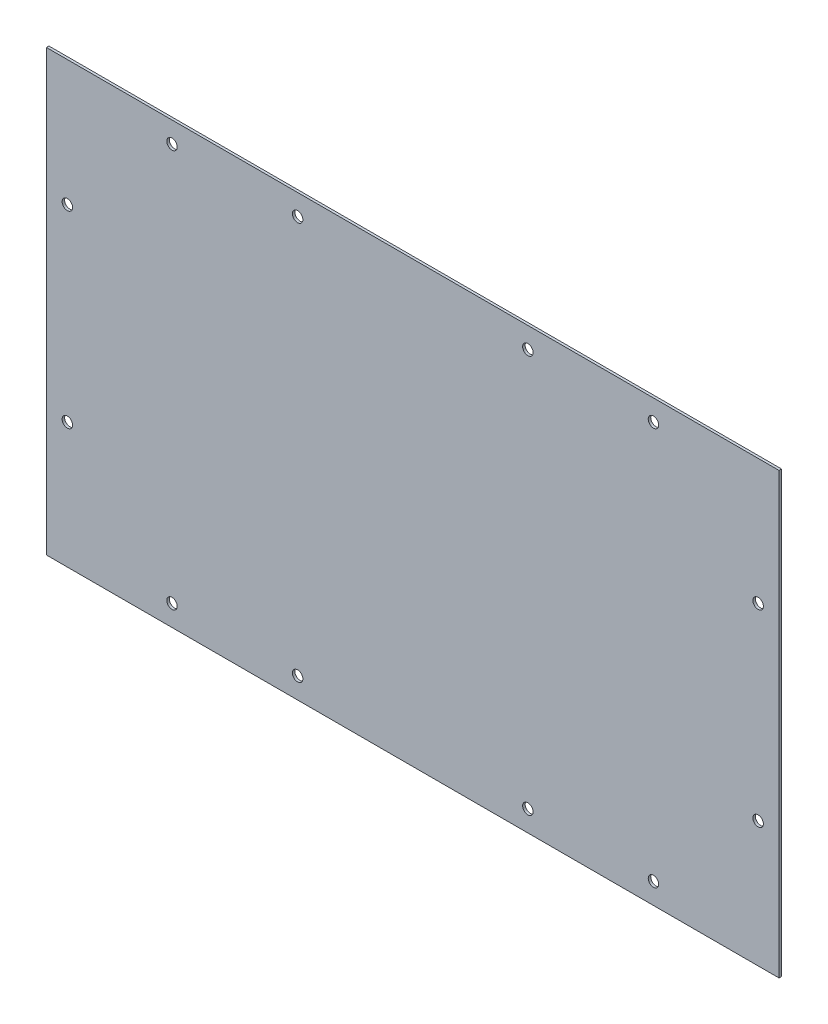
ISO-10303-21;
HEADER;
FILE_DESCRIPTION(('STEP AP214'),'2;1');
FILE_NAME('part.step','',(''),(''),'','','');
FILE_SCHEMA(('AUTOMOTIVE_DESIGN { 1 0 10303 214 1 1 1 1 }'));
ENDSEC;
DATA;
#1=APPLICATION_CONTEXT('core data for automotive mechanical design processes');
#2=APPLICATION_PROTOCOL_DEFINITION('international standard','automotive_design',2000,#1);
#3=PRODUCT_CONTEXT('',#1,'mechanical');
#4=PRODUCT('Part','Part','',(#3));
#5=PRODUCT_RELATED_PRODUCT_CATEGORY('part','',(#4));
#6=PRODUCT_DEFINITION_FORMATION('','',#4);
#7=PRODUCT_DEFINITION_CONTEXT('part definition',#1,'design');
#8=PRODUCT_DEFINITION('design','',#6,#7);
#9=PRODUCT_DEFINITION_SHAPE('','',#8);
#10=(LENGTH_UNIT() NAMED_UNIT(*) SI_UNIT(.MILLI.,.METRE.));
#11=(NAMED_UNIT(*) PLANE_ANGLE_UNIT() SI_UNIT($,.RADIAN.));
#12=(NAMED_UNIT(*) SI_UNIT($,.STERADIAN.) SOLID_ANGLE_UNIT());
#13=UNCERTAINTY_MEASURE_WITH_UNIT(LENGTH_MEASURE(1.E-05),#10,'distance_accuracy_value','');
#14=(GEOMETRIC_REPRESENTATION_CONTEXT(3) GLOBAL_UNCERTAINTY_ASSIGNED_CONTEXT((#13)) GLOBAL_UNIT_ASSIGNED_CONTEXT((#10,
#11,#12)) REPRESENTATION_CONTEXT('',''));
#15=CARTESIAN_POINT('',(0.,0.,0.));
#16=DIRECTION('',(0.,0.,1.));
#17=DIRECTION('',(1.,0.,0.));
#18=AXIS2_PLACEMENT_3D('',#15,#16,#17);
#19=CARTESIAN_POINT('',(0.,0.,0.));
#20=DIRECTION('',(-1.,0.,0.));
#21=DIRECTION('',(0.,1.,0.));
#22=AXIS2_PLACEMENT_3D('',#19,#20,#21);
#23=PLANE('',#22);
#24=DIRECTION('',(0.,0.,-1.));
#25=VECTOR('',#24,1.);
#26=CARTESIAN_POINT('',(0.,0.,0.));
#27=LINE('',#26,#25);
#28=CARTESIAN_POINT('',(0.,0.,1.2));
#29=VERTEX_POINT('',#28);
#30=CARTESIAN_POINT('',(0.,0.,0.));
#31=VERTEX_POINT('',#30);
#32=EDGE_CURVE('E11',#29,#31,#27,.T.);
#33=ORIENTED_EDGE('',*,*,#32,.F.);
#34=DIRECTION('',(0.,1.,0.));
#35=VECTOR('',#34,1.);
#36=CARTESIAN_POINT('',(0.,0.,1.2));
#37=LINE('',#36,#35);
#38=CARTESIAN_POINT('',(0.,210.,1.2));
#39=VERTEX_POINT('',#38);
#40=EDGE_CURVE('E70',#29,#39,#37,.T.);
#41=ORIENTED_EDGE('',*,*,#40,.T.);
#42=DIRECTION('',(0.,0.,-1.));
#43=VECTOR('',#42,1.);
#44=CARTESIAN_POINT('',(0.,210.,0.));
#45=LINE('',#44,#43);
#46=CARTESIAN_POINT('',(0.,210.,0.));
#47=VERTEX_POINT('',#46);
#48=EDGE_CURVE('E45',#39,#47,#45,.T.);
#49=ORIENTED_EDGE('',*,*,#48,.T.);
#50=DIRECTION('',(0.,1.,0.));
#51=VECTOR('',#50,1.);
#52=CARTESIAN_POINT('',(0.,0.,0.));
#53=LINE('',#52,#51);
#54=EDGE_CURVE('E72',#31,#47,#53,.T.);
#55=ORIENTED_EDGE('',*,*,#54,.F.);
#56=EDGE_LOOP('',(#33,#41,#49,#55));
#57=FACE_BOUND('',#56,.T.);
#58=ADVANCED_FACE('F35',(#57),#23,.T.);
#59=CARTESIAN_POINT('',(0.,210.,0.));
#60=DIRECTION('',(0.,1.,0.));
#61=DIRECTION('',(1.,0.,0.));
#62=AXIS2_PLACEMENT_3D('',#59,#60,#61);
#63=PLANE('',#62);
#64=ORIENTED_EDGE('',*,*,#48,.F.);
#65=DIRECTION('',(-1.,0.,0.));
#66=VECTOR('',#65,1.);
#67=CARTESIAN_POINT('',(0.,210.,1.2));
#68=LINE('',#67,#66);
#69=CARTESIAN_POINT('',(350.,210.,1.2));
#70=VERTEX_POINT('',#69);
#71=EDGE_CURVE('E84',#39,#70,#68,.F.);
#72=ORIENTED_EDGE('',*,*,#71,.T.);
#73=DIRECTION('',(0.,0.,-1.));
#74=VECTOR('',#73,1.);
#75=CARTESIAN_POINT('',(350.,210.,0.));
#76=LINE('',#75,#74);
#77=CARTESIAN_POINT('',(350.,210.,0.));
#78=VERTEX_POINT('',#77);
#79=EDGE_CURVE('E93',#70,#78,#76,.T.);
#80=ORIENTED_EDGE('',*,*,#79,.T.);
#81=DIRECTION('',(1.,0.,0.));
#82=VECTOR('',#81,1.);
#83=CARTESIAN_POINT('',(0.,210.,0.));
#84=LINE('',#83,#82);
#85=EDGE_CURVE('E97',#47,#78,#84,.T.);
#86=ORIENTED_EDGE('',*,*,#85,.F.);
#87=EDGE_LOOP('',(#64,#72,#80,#86));
#88=FACE_BOUND('',#87,.T.);
#89=ADVANCED_FACE('F150',(#88),#63,.T.);
#90=CARTESIAN_POINT('',(350.,0.,0.));
#91=DIRECTION('',(-1.,0.,0.));
#92=DIRECTION('',(0.,1.,0.));
#93=AXIS2_PLACEMENT_3D('',#90,#91,#92);
#94=PLANE('',#93);
#95=ORIENTED_EDGE('',*,*,#79,.F.);
#96=DIRECTION('',(0.,1.,0.));
#97=VECTOR('',#96,1.);
#98=CARTESIAN_POINT('',(350.,0.,1.2));
#99=LINE('',#98,#97);
#100=CARTESIAN_POINT('',(350.,0.,1.2));
#101=VERTEX_POINT('',#100);
#102=EDGE_CURVE('E88',#101,#70,#99,.T.);
#103=ORIENTED_EDGE('',*,*,#102,.F.);
#104=DIRECTION('',(0.,0.,-1.));
#105=VECTOR('',#104,1.);
#106=CARTESIAN_POINT('',(350.,0.,0.));
#107=LINE('',#106,#105);
#108=CARTESIAN_POINT('',(350.,0.,0.));
#109=VERTEX_POINT('',#108);
#110=EDGE_CURVE('E87',#101,#109,#107,.T.);
#111=ORIENTED_EDGE('',*,*,#110,.T.);
#112=DIRECTION('',(0.,1.,0.));
#113=VECTOR('',#112,1.);
#114=CARTESIAN_POINT('',(350.,0.,0.));
#115=LINE('',#114,#113);
#116=EDGE_CURVE('E272',#109,#78,#115,.T.);
#117=ORIENTED_EDGE('',*,*,#116,.T.);
#118=EDGE_LOOP('',(#95,#103,#111,#117));
#119=FACE_BOUND('',#118,.T.);
#120=ADVANCED_FACE('F154',(#119),#94,.F.);
#121=CARTESIAN_POINT('',(0.,0.,0.));
#122=DIRECTION('',(0.,1.,0.));
#123=DIRECTION('',(1.,0.,0.));
#124=AXIS2_PLACEMENT_3D('',#121,#122,#123);
#125=PLANE('',#124);
#126=DIRECTION('',(-1.,0.,0.));
#127=VECTOR('',#126,1.);
#128=CARTESIAN_POINT('',(0.,0.,1.2));
#129=LINE('',#128,#127);
#130=EDGE_CURVE('E81',#29,#101,#129,.F.);
#131=ORIENTED_EDGE('',*,*,#130,.F.);
#132=ORIENTED_EDGE('',*,*,#32,.T.);
#133=DIRECTION('',(1.,0.,0.));
#134=VECTOR('',#133,1.);
#135=CARTESIAN_POINT('',(0.,0.,0.));
#136=LINE('',#135,#134);
#137=EDGE_CURVE('E271',#31,#109,#136,.T.);
#138=ORIENTED_EDGE('',*,*,#137,.T.);
#139=ORIENTED_EDGE('',*,*,#110,.F.);
#140=EDGE_LOOP('',(#131,#132,#138,#139));
#141=FACE_BOUND('',#140,.T.);
#142=ADVANCED_FACE('F37',(#141),#125,.F.);
#143=CARTESIAN_POINT('',(0.,0.,0.));
#144=DIRECTION('',(0.,0.,-1.));
#145=DIRECTION('',(-1.,0.,0.));
#146=AXIS2_PLACEMENT_3D('',#143,#144,#145);
#147=PLANE('',#146);
#148=CARTESIAN_POINT('',(120.,10.,0.));
#149=DIRECTION('',(0.,0.,-1.));
#150=DIRECTION('',(-1.,0.,0.));
#151=AXIS2_PLACEMENT_3D('',#148,#149,#150);
#152=CIRCLE('',#151,2.5);
#153=CARTESIAN_POINT('',(117.5,10.,0.));
#154=VERTEX_POINT('',#153);
#155=EDGE_CURVE('E253',#154,#154,#152,.T.);
#156=ORIENTED_EDGE('',*,*,#155,.F.);
#157=EDGE_LOOP('',(#156));
#158=FACE_BOUND('',#157,.T.);
#159=CARTESIAN_POINT('',(60.,10.,0.));
#160=DIRECTION('',(0.,0.,-1.));
#161=DIRECTION('',(-1.,0.,0.));
#162=AXIS2_PLACEMENT_3D('',#159,#160,#161);
#163=CIRCLE('',#162,2.50000000000002);
#164=CARTESIAN_POINT('',(57.5,10.,0.));
#165=VERTEX_POINT('',#164);
#166=EDGE_CURVE('E247',#165,#165,#163,.T.);
#167=ORIENTED_EDGE('',*,*,#166,.F.);
#168=EDGE_LOOP('',(#167));
#169=FACE_BOUND('',#168,.T.);
#170=CARTESIAN_POINT('',(10.,60.0000000000001,0.));
#171=DIRECTION('',(0.,0.,-1.));
#172=DIRECTION('',(-1.,0.,0.));
#173=AXIS2_PLACEMENT_3D('',#170,#171,#172);
#174=CIRCLE('',#173,2.50000000000002);
#175=CARTESIAN_POINT('',(7.49999999999998,60.0000000000001,0.));
#176=VERTEX_POINT('',#175);
#177=EDGE_CURVE('E230',#176,#176,#174,.T.);
#178=ORIENTED_EDGE('',*,*,#177,.F.);
#179=EDGE_LOOP('',(#178));
#180=FACE_BOUND('',#179,.T.);
#181=CARTESIAN_POINT('',(60.,200.,0.));
#182=DIRECTION('',(0.,0.,-1.));
#183=DIRECTION('',(1.,0.,0.));
#184=AXIS2_PLACEMENT_3D('',#181,#182,#183);
#185=CIRCLE('',#184,2.50000000000002);
#186=CARTESIAN_POINT('',(62.5,200.,0.));
#187=VERTEX_POINT('',#186);
#188=EDGE_CURVE('E246',#187,#187,#185,.T.);
#189=ORIENTED_EDGE('',*,*,#188,.F.);
#190=EDGE_LOOP('',(#189));
#191=FACE_BOUND('',#190,.T.);
#192=CARTESIAN_POINT('',(120.,200.,0.));
#193=DIRECTION('',(0.,0.,-1.));
#194=DIRECTION('',(1.,0.,0.));
#195=AXIS2_PLACEMENT_3D('',#192,#193,#194);
#196=CIRCLE('',#195,2.5);
#197=CARTESIAN_POINT('',(122.5,200.,0.));
#198=VERTEX_POINT('',#197);
#199=EDGE_CURVE('E250',#198,#198,#196,.T.);
#200=ORIENTED_EDGE('',*,*,#199,.F.);
#201=EDGE_LOOP('',(#200));
#202=FACE_BOUND('',#201,.T.);
#203=CARTESIAN_POINT('',(10.,150.,0.));
#204=DIRECTION('',(0.,0.,-1.));
#205=DIRECTION('',(1.,0.,0.));
#206=AXIS2_PLACEMENT_3D('',#203,#204,#205);
#207=CIRCLE('',#206,2.50000000000002);
#208=CARTESIAN_POINT('',(12.5,150.,0.));
#209=VERTEX_POINT('',#208);
#210=EDGE_CURVE('E263',#209,#209,#207,.T.);
#211=ORIENTED_EDGE('',*,*,#210,.F.);
#212=EDGE_LOOP('',(#211));
#213=FACE_BOUND('',#212,.T.);
#214=CARTESIAN_POINT('',(230.,200.,0.));
#215=DIRECTION('',(0.,0.,-1.));
#216=DIRECTION('',(-1.,0.,0.));
#217=AXIS2_PLACEMENT_3D('',#214,#215,#216);
#218=CIRCLE('',#217,2.5);
#219=CARTESIAN_POINT('',(227.5,200.,0.));
#220=VERTEX_POINT('',#219);
#221=EDGE_CURVE('E260',#220,#220,#218,.T.);
#222=ORIENTED_EDGE('',*,*,#221,.F.);
#223=EDGE_LOOP('',(#222));
#224=FACE_BOUND('',#223,.T.);
#225=CARTESIAN_POINT('',(290.,200.,0.));
#226=DIRECTION('',(0.,0.,-1.));
#227=DIRECTION('',(-1.,0.,0.));
#228=AXIS2_PLACEMENT_3D('',#225,#226,#227);
#229=CIRCLE('',#228,2.50000000000002);
#230=CARTESIAN_POINT('',(287.5,200.,0.));
#231=VERTEX_POINT('',#230);
#232=EDGE_CURVE('E197',#231,#231,#229,.T.);
#233=ORIENTED_EDGE('',*,*,#232,.F.);
#234=EDGE_LOOP('',(#233));
#235=FACE_BOUND('',#234,.T.);
#236=CARTESIAN_POINT('',(230.,10.,0.));
#237=DIRECTION('',(0.,0.,-1.));
#238=DIRECTION('',(1.,0.,0.));
#239=AXIS2_PLACEMENT_3D('',#236,#237,#238);
#240=CIRCLE('',#239,2.5);
#241=CARTESIAN_POINT('',(232.5,10.,0.));
#242=VERTEX_POINT('',#241);
#243=EDGE_CURVE('E258',#242,#242,#240,.T.);
#244=ORIENTED_EDGE('',*,*,#243,.F.);
#245=EDGE_LOOP('',(#244));
#246=FACE_BOUND('',#245,.T.);
#247=CARTESIAN_POINT('',(290.,10.,0.));
#248=DIRECTION('',(0.,0.,-1.));
#249=DIRECTION('',(1.,0.,0.));
#250=AXIS2_PLACEMENT_3D('',#247,#248,#249);
#251=CIRCLE('',#250,2.50000000000002);
#252=CARTESIAN_POINT('',(292.5,10.,0.));
#253=VERTEX_POINT('',#252);
#254=EDGE_CURVE('E296',#253,#253,#251,.T.);
#255=ORIENTED_EDGE('',*,*,#254,.F.);
#256=EDGE_LOOP('',(#255));
#257=FACE_BOUND('',#256,.T.);
#258=CARTESIAN_POINT('',(340.,60.0000000000001,0.));
#259=DIRECTION('',(0.,0.,-1.));
#260=DIRECTION('',(1.,0.,0.));
#261=AXIS2_PLACEMENT_3D('',#258,#259,#260);
#262=CIRCLE('',#261,2.50000000000002);
#263=CARTESIAN_POINT('',(342.5,60.0000000000001,0.));
#264=VERTEX_POINT('',#263);
#265=EDGE_CURVE('E298',#264,#264,#262,.T.);
#266=ORIENTED_EDGE('',*,*,#265,.F.);
#267=EDGE_LOOP('',(#266));
#268=FACE_BOUND('',#267,.T.);
#269=CARTESIAN_POINT('',(340.,150.,0.));
#270=DIRECTION('',(0.,0.,-1.));
#271=DIRECTION('',(-1.,0.,0.));
#272=AXIS2_PLACEMENT_3D('',#269,#270,#271);
#273=CIRCLE('',#272,2.50000000000002);
#274=CARTESIAN_POINT('',(337.5,150.,0.));
#275=VERTEX_POINT('',#274);
#276=EDGE_CURVE('E102',#275,#275,#273,.T.);
#277=ORIENTED_EDGE('',*,*,#276,.F.);
#278=EDGE_LOOP('',(#277));
#279=FACE_BOUND('',#278,.T.);
#280=ORIENTED_EDGE('',*,*,#116,.F.);
#281=ORIENTED_EDGE('',*,*,#137,.F.);
#282=ORIENTED_EDGE('',*,*,#54,.T.);
#283=ORIENTED_EDGE('',*,*,#85,.T.);
#284=EDGE_LOOP('',(#280,#281,#282,#283));
#285=FACE_BOUND('',#284,.T.);
#286=ADVANCED_FACE('F164',(#158,#169,#180,#191,#202,#213,#224,#235,#246,#257,#268,#279,#285),
#147,.T.);
#287=CARTESIAN_POINT('',(0.,0.,1.2));
#288=DIRECTION('',(0.,0.,-1.));
#289=DIRECTION('',(-1.,0.,0.));
#290=AXIS2_PLACEMENT_3D('',#287,#288,#289);
#291=PLANE('',#290);
#292=CARTESIAN_POINT('',(120.,10.,1.2));
#293=DIRECTION('',(0.,0.,-1.));
#294=DIRECTION('',(-1.,0.,0.));
#295=AXIS2_PLACEMENT_3D('',#292,#293,#294);
#296=CIRCLE('',#295,2.5);
#297=CARTESIAN_POINT('',(117.5,10.,1.2));
#298=VERTEX_POINT('',#297);
#299=EDGE_CURVE('E39',#298,#298,#296,.T.);
#300=ORIENTED_EDGE('',*,*,#299,.T.);
#301=EDGE_LOOP('',(#300));
#302=FACE_BOUND('',#301,.T.);
#303=CARTESIAN_POINT('',(60.,10.,1.2));
#304=DIRECTION('',(0.,0.,-1.));
#305=DIRECTION('',(-1.,0.,0.));
#306=AXIS2_PLACEMENT_3D('',#303,#304,#305);
#307=CIRCLE('',#306,2.50000000000002);
#308=CARTESIAN_POINT('',(57.5,10.,1.2));
#309=VERTEX_POINT('',#308);
#310=EDGE_CURVE('E128',#309,#309,#307,.T.);
#311=ORIENTED_EDGE('',*,*,#310,.T.);
#312=EDGE_LOOP('',(#311));
#313=FACE_BOUND('',#312,.T.);
#314=CARTESIAN_POINT('',(10.,60.0000000000001,1.2));
#315=DIRECTION('',(0.,0.,-1.));
#316=DIRECTION('',(-1.,0.,0.));
#317=AXIS2_PLACEMENT_3D('',#314,#315,#316);
#318=CIRCLE('',#317,2.50000000000002);
#319=CARTESIAN_POINT('',(7.49999999999998,60.0000000000001,1.2));
#320=VERTEX_POINT('',#319);
#321=EDGE_CURVE('E126',#320,#320,#318,.T.);
#322=ORIENTED_EDGE('',*,*,#321,.T.);
#323=EDGE_LOOP('',(#322));
#324=FACE_BOUND('',#323,.T.);
#325=CARTESIAN_POINT('',(60.,200.,1.2));
#326=DIRECTION('',(0.,0.,-1.));
#327=DIRECTION('',(-1.,0.,0.));
#328=AXIS2_PLACEMENT_3D('',#325,#326,#327);
#329=CIRCLE('',#328,2.50000000000002);
#330=CARTESIAN_POINT('',(57.5,200.,1.2));
#331=VERTEX_POINT('',#330);
#332=EDGE_CURVE('E123',#331,#331,#329,.T.);
#333=ORIENTED_EDGE('',*,*,#332,.T.);
#334=EDGE_LOOP('',(#333));
#335=FACE_BOUND('',#334,.T.);
#336=CARTESIAN_POINT('',(120.,200.,1.2));
#337=DIRECTION('',(0.,0.,-1.));
#338=DIRECTION('',(-1.,0.,0.));
#339=AXIS2_PLACEMENT_3D('',#336,#337,#338);
#340=CIRCLE('',#339,2.5);
#341=CARTESIAN_POINT('',(117.5,200.,1.2));
#342=VERTEX_POINT('',#341);
#343=EDGE_CURVE('E120',#342,#342,#340,.T.);
#344=ORIENTED_EDGE('',*,*,#343,.T.);
#345=EDGE_LOOP('',(#344));
#346=FACE_BOUND('',#345,.T.);
#347=CARTESIAN_POINT('',(10.,150.,1.2));
#348=DIRECTION('',(0.,0.,-1.));
#349=DIRECTION('',(-1.,0.,0.));
#350=AXIS2_PLACEMENT_3D('',#347,#348,#349);
#351=CIRCLE('',#350,2.50000000000002);
#352=CARTESIAN_POINT('',(7.49999999999999,150.,1.2));
#353=VERTEX_POINT('',#352);
#354=EDGE_CURVE('E117',#353,#353,#351,.T.);
#355=ORIENTED_EDGE('',*,*,#354,.T.);
#356=EDGE_LOOP('',(#355));
#357=FACE_BOUND('',#356,.T.);
#358=CARTESIAN_POINT('',(230.,200.,1.2));
#359=DIRECTION('',(0.,0.,-1.));
#360=DIRECTION('',(-1.,0.,0.));
#361=AXIS2_PLACEMENT_3D('',#358,#359,#360);
#362=CIRCLE('',#361,2.5);
#363=CARTESIAN_POINT('',(227.5,200.,1.2));
#364=VERTEX_POINT('',#363);
#365=EDGE_CURVE('E114',#364,#364,#362,.T.);
#366=ORIENTED_EDGE('',*,*,#365,.T.);
#367=EDGE_LOOP('',(#366));
#368=FACE_BOUND('',#367,.T.);
#369=CARTESIAN_POINT('',(290.,200.,1.2));
#370=DIRECTION('',(0.,0.,-1.));
#371=DIRECTION('',(-1.,0.,0.));
#372=AXIS2_PLACEMENT_3D('',#369,#370,#371);
#373=CIRCLE('',#372,2.50000000000002);
#374=CARTESIAN_POINT('',(287.5,200.,1.2));
#375=VERTEX_POINT('',#374);
#376=EDGE_CURVE('E111',#375,#375,#373,.T.);
#377=ORIENTED_EDGE('',*,*,#376,.T.);
#378=EDGE_LOOP('',(#377));
#379=FACE_BOUND('',#378,.T.);
#380=CARTESIAN_POINT('',(230.,10.,1.2));
#381=DIRECTION('',(0.,0.,-1.));
#382=DIRECTION('',(-1.,0.,0.));
#383=AXIS2_PLACEMENT_3D('',#380,#381,#382);
#384=CIRCLE('',#383,2.5);
#385=CARTESIAN_POINT('',(227.5,10.,1.2));
#386=VERTEX_POINT('',#385);
#387=EDGE_CURVE('E108',#386,#386,#384,.T.);
#388=ORIENTED_EDGE('',*,*,#387,.T.);
#389=EDGE_LOOP('',(#388));
#390=FACE_BOUND('',#389,.T.);
#391=CARTESIAN_POINT('',(290.,10.,1.2));
#392=DIRECTION('',(0.,0.,-1.));
#393=DIRECTION('',(-1.,0.,0.));
#394=AXIS2_PLACEMENT_3D('',#391,#392,#393);
#395=CIRCLE('',#394,2.50000000000002);
#396=CARTESIAN_POINT('',(287.5,10.,1.2));
#397=VERTEX_POINT('',#396);
#398=EDGE_CURVE('E105',#397,#397,#395,.T.);
#399=ORIENTED_EDGE('',*,*,#398,.T.);
#400=EDGE_LOOP('',(#399));
#401=FACE_BOUND('',#400,.T.);
#402=CARTESIAN_POINT('',(340.,60.0000000000001,1.2));
#403=DIRECTION('',(0.,0.,-1.));
#404=DIRECTION('',(-1.,0.,0.));
#405=AXIS2_PLACEMENT_3D('',#402,#403,#404);
#406=CIRCLE('',#405,2.50000000000002);
#407=CARTESIAN_POINT('',(337.5,60.0000000000001,1.2));
#408=VERTEX_POINT('',#407);
#409=EDGE_CURVE('E101',#408,#408,#406,.T.);
#410=ORIENTED_EDGE('',*,*,#409,.T.);
#411=EDGE_LOOP('',(#410));
#412=FACE_BOUND('',#411,.T.);
#413=CARTESIAN_POINT('',(340.,150.,1.2));
#414=DIRECTION('',(0.,0.,-1.));
#415=DIRECTION('',(-1.,0.,0.));
#416=AXIS2_PLACEMENT_3D('',#413,#414,#415);
#417=CIRCLE('',#416,2.50000000000002);
#418=CARTESIAN_POINT('',(337.5,150.,1.2));
#419=VERTEX_POINT('',#418);
#420=EDGE_CURVE('E98',#419,#419,#417,.T.);
#421=ORIENTED_EDGE('',*,*,#420,.T.);
#422=EDGE_LOOP('',(#421));
#423=FACE_BOUND('',#422,.T.);
#424=ORIENTED_EDGE('',*,*,#102,.T.);
#425=ORIENTED_EDGE('',*,*,#71,.F.);
#426=ORIENTED_EDGE('',*,*,#40,.F.);
#427=ORIENTED_EDGE('',*,*,#130,.T.);
#428=EDGE_LOOP('',(#424,#425,#426,#427));
#429=FACE_BOUND('',#428,.T.);
#430=ADVANCED_FACE('F80',(#302,#313,#324,#335,#346,#357,#368,#379,#390,#401,#412,#423,#429),
#291,.F.);
#431=CARTESIAN_POINT('',(340.,150.,10.));
#432=DIRECTION('',(0.,0.,-1.));
#433=DIRECTION('',(-1.,0.,0.));
#434=AXIS2_PLACEMENT_3D('',#431,#432,#433);
#435=CYLINDRICAL_SURFACE('',#434,2.50000000000002);
#436=ORIENTED_EDGE('',*,*,#276,.T.);
#437=EDGE_LOOP('',(#436));
#438=FACE_BOUND('',#437,.T.);
#439=ORIENTED_EDGE('',*,*,#420,.F.);
#440=EDGE_LOOP('',(#439));
#441=FACE_BOUND('',#440,.T.);
#442=ADVANCED_FACE('F163',(#438,#441),#435,.F.);
#443=CARTESIAN_POINT('',(340.,60.0000000000001,10.));
#444=DIRECTION('',(0.,0.,-1.));
#445=DIRECTION('',(-1.,0.,0.));
#446=AXIS2_PLACEMENT_3D('',#443,#444,#445);
#447=CYLINDRICAL_SURFACE('',#446,2.50000000000002);
#448=ORIENTED_EDGE('',*,*,#265,.T.);
#449=EDGE_LOOP('',(#448));
#450=FACE_BOUND('',#449,.T.);
#451=ORIENTED_EDGE('',*,*,#409,.F.);
#452=EDGE_LOOP('',(#451));
#453=FACE_BOUND('',#452,.T.);
#454=ADVANCED_FACE('F170',(#450,#453),#447,.F.);
#455=CARTESIAN_POINT('',(290.,10.,10.));
#456=DIRECTION('',(0.,0.,-1.));
#457=DIRECTION('',(-1.,0.,0.));
#458=AXIS2_PLACEMENT_3D('',#455,#456,#457);
#459=CYLINDRICAL_SURFACE('',#458,2.50000000000002);
#460=ORIENTED_EDGE('',*,*,#254,.T.);
#461=EDGE_LOOP('',(#460));
#462=FACE_BOUND('',#461,.T.);
#463=ORIENTED_EDGE('',*,*,#398,.F.);
#464=EDGE_LOOP('',(#463));
#465=FACE_BOUND('',#464,.T.);
#466=ADVANCED_FACE('F191',(#462,#465),#459,.F.);
#467=CARTESIAN_POINT('',(230.,10.,10.));
#468=DIRECTION('',(0.,0.,-1.));
#469=DIRECTION('',(-1.,0.,0.));
#470=AXIS2_PLACEMENT_3D('',#467,#468,#469);
#471=CYLINDRICAL_SURFACE('',#470,2.5);
#472=ORIENTED_EDGE('',*,*,#243,.T.);
#473=EDGE_LOOP('',(#472));
#474=FACE_BOUND('',#473,.T.);
#475=ORIENTED_EDGE('',*,*,#387,.F.);
#476=EDGE_LOOP('',(#475));
#477=FACE_BOUND('',#476,.T.);
#478=ADVANCED_FACE('F186',(#474,#477),#471,.F.);
#479=CARTESIAN_POINT('',(290.,200.,10.));
#480=DIRECTION('',(0.,0.,-1.));
#481=DIRECTION('',(-1.,0.,0.));
#482=AXIS2_PLACEMENT_3D('',#479,#480,#481);
#483=CYLINDRICAL_SURFACE('',#482,2.50000000000002);
#484=ORIENTED_EDGE('',*,*,#232,.T.);
#485=EDGE_LOOP('',(#484));
#486=FACE_BOUND('',#485,.T.);
#487=ORIENTED_EDGE('',*,*,#376,.F.);
#488=EDGE_LOOP('',(#487));
#489=FACE_BOUND('',#488,.T.);
#490=ADVANCED_FACE('F183',(#486,#489),#483,.F.);
#491=CARTESIAN_POINT('',(230.,200.,10.));
#492=DIRECTION('',(0.,0.,-1.));
#493=DIRECTION('',(-1.,0.,0.));
#494=AXIS2_PLACEMENT_3D('',#491,#492,#493);
#495=CYLINDRICAL_SURFACE('',#494,2.5);
#496=ORIENTED_EDGE('',*,*,#221,.T.);
#497=EDGE_LOOP('',(#496));
#498=FACE_BOUND('',#497,.T.);
#499=ORIENTED_EDGE('',*,*,#365,.F.);
#500=EDGE_LOOP('',(#499));
#501=FACE_BOUND('',#500,.T.);
#502=ADVANCED_FACE('F180',(#498,#501),#495,.F.);
#503=CARTESIAN_POINT('',(10.,150.,10.));
#504=DIRECTION('',(0.,0.,-1.));
#505=DIRECTION('',(-1.,0.,0.));
#506=AXIS2_PLACEMENT_3D('',#503,#504,#505);
#507=CYLINDRICAL_SURFACE('',#506,2.50000000000002);
#508=ORIENTED_EDGE('',*,*,#210,.T.);
#509=EDGE_LOOP('',(#508));
#510=FACE_BOUND('',#509,.T.);
#511=ORIENTED_EDGE('',*,*,#354,.F.);
#512=EDGE_LOOP('',(#511));
#513=FACE_BOUND('',#512,.T.);
#514=ADVANCED_FACE('F176',(#510,#513),#507,.F.);
#515=CARTESIAN_POINT('',(120.,200.,10.));
#516=DIRECTION('',(0.,0.,-1.));
#517=DIRECTION('',(-1.,0.,0.));
#518=AXIS2_PLACEMENT_3D('',#515,#516,#517);
#519=CYLINDRICAL_SURFACE('',#518,2.5);
#520=ORIENTED_EDGE('',*,*,#199,.T.);
#521=EDGE_LOOP('',(#520));
#522=FACE_BOUND('',#521,.T.);
#523=ORIENTED_EDGE('',*,*,#343,.F.);
#524=EDGE_LOOP('',(#523));
#525=FACE_BOUND('',#524,.T.);
#526=ADVANCED_FACE('F172',(#522,#525),#519,.F.);
#527=CARTESIAN_POINT('',(60.,200.,10.));
#528=DIRECTION('',(0.,0.,-1.));
#529=DIRECTION('',(-1.,0.,0.));
#530=AXIS2_PLACEMENT_3D('',#527,#528,#529);
#531=CYLINDRICAL_SURFACE('',#530,2.50000000000002);
#532=ORIENTED_EDGE('',*,*,#188,.T.);
#533=EDGE_LOOP('',(#532));
#534=FACE_BOUND('',#533,.T.);
#535=ORIENTED_EDGE('',*,*,#332,.F.);
#536=EDGE_LOOP('',(#535));
#537=FACE_BOUND('',#536,.T.);
#538=ADVANCED_FACE('F175',(#534,#537),#531,.F.);
#539=CARTESIAN_POINT('',(10.,60.0000000000001,10.));
#540=DIRECTION('',(0.,0.,-1.));
#541=DIRECTION('',(-1.,0.,0.));
#542=AXIS2_PLACEMENT_3D('',#539,#540,#541);
#543=CYLINDRICAL_SURFACE('',#542,2.50000000000002);
#544=ORIENTED_EDGE('',*,*,#177,.T.);
#545=EDGE_LOOP('',(#544));
#546=FACE_BOUND('',#545,.T.);
#547=ORIENTED_EDGE('',*,*,#321,.F.);
#548=EDGE_LOOP('',(#547));
#549=FACE_BOUND('',#548,.T.);
#550=ADVANCED_FACE('F144',(#546,#549),#543,.F.);
#551=CARTESIAN_POINT('',(60.,10.,10.));
#552=DIRECTION('',(0.,0.,-1.));
#553=DIRECTION('',(-1.,0.,0.));
#554=AXIS2_PLACEMENT_3D('',#551,#552,#553);
#555=CYLINDRICAL_SURFACE('',#554,2.50000000000002);
#556=ORIENTED_EDGE('',*,*,#166,.T.);
#557=EDGE_LOOP('',(#556));
#558=FACE_BOUND('',#557,.T.);
#559=ORIENTED_EDGE('',*,*,#310,.F.);
#560=EDGE_LOOP('',(#559));
#561=FACE_BOUND('',#560,.T.);
#562=ADVANCED_FACE('F138',(#558,#561),#555,.F.);
#563=CARTESIAN_POINT('',(120.,10.,10.));
#564=DIRECTION('',(0.,0.,-1.));
#565=DIRECTION('',(-1.,0.,0.));
#566=AXIS2_PLACEMENT_3D('',#563,#564,#565);
#567=CYLINDRICAL_SURFACE('',#566,2.5);
#568=ORIENTED_EDGE('',*,*,#155,.T.);
#569=EDGE_LOOP('',(#568));
#570=FACE_BOUND('',#569,.T.);
#571=ORIENTED_EDGE('',*,*,#299,.F.);
#572=EDGE_LOOP('',(#571));
#573=FACE_BOUND('',#572,.T.);
#574=ADVANCED_FACE('F136',(#570,#573),#567,.F.);
#575=CLOSED_SHELL('',(#58,#89,#120,#142,#286,#430,#442,#454,#466,#478,#490,#502,#514,#526,#538,
#550,#562,#574));
#576=MANIFOLD_SOLID_BREP('B2',#575);
#577=ADVANCED_BREP_SHAPE_REPRESENTATION('',(#18,#576),#14);
#578=SHAPE_DEFINITION_REPRESENTATION(#9,#577);
ENDSEC;
END-ISO-10303-21;
